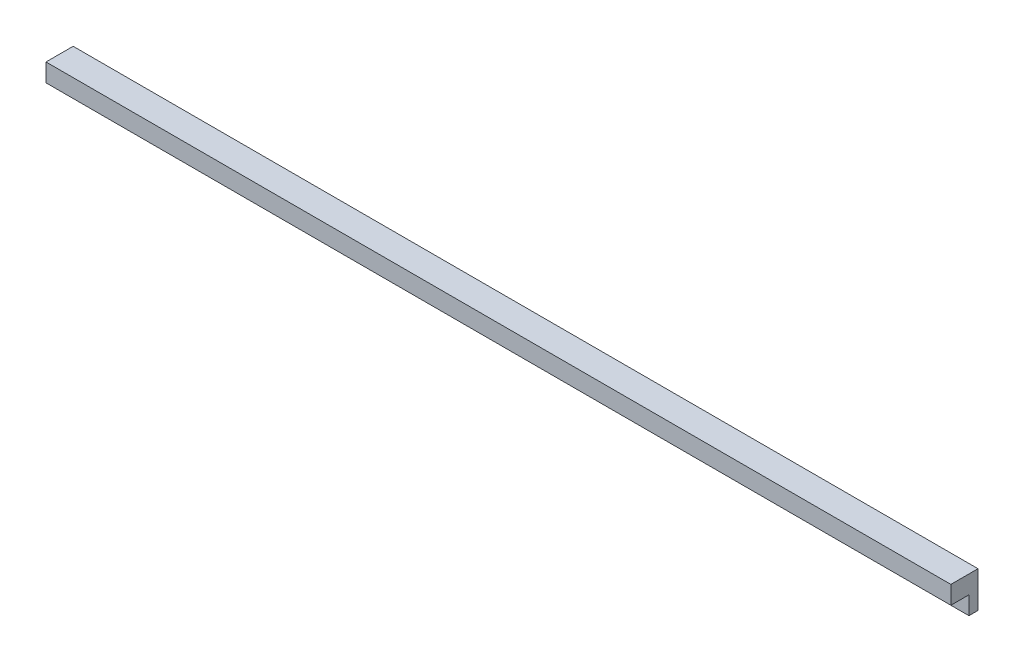
ISO-10303-21;
HEADER;
FILE_DESCRIPTION(('STEP AP214'),'2;1');
FILE_NAME('part.step','',(''),(''),'','','');
FILE_SCHEMA(('AUTOMOTIVE_DESIGN { 1 0 10303 214 1 1 1 1 }'));
ENDSEC;
DATA;
#1=APPLICATION_CONTEXT('core data for automotive mechanical design processes');
#2=APPLICATION_PROTOCOL_DEFINITION('international standard','automotive_design',2000,#1);
#3=PRODUCT_CONTEXT('',#1,'mechanical');
#4=PRODUCT('Part','Part','',(#3));
#5=PRODUCT_RELATED_PRODUCT_CATEGORY('part','',(#4));
#6=PRODUCT_DEFINITION_FORMATION('','',#4);
#7=PRODUCT_DEFINITION_CONTEXT('part definition',#1,'design');
#8=PRODUCT_DEFINITION('design','',#6,#7);
#9=PRODUCT_DEFINITION_SHAPE('','',#8);
#10=(LENGTH_UNIT() NAMED_UNIT(*) SI_UNIT(.MILLI.,.METRE.));
#11=(NAMED_UNIT(*) PLANE_ANGLE_UNIT() SI_UNIT($,.RADIAN.));
#12=(NAMED_UNIT(*) SI_UNIT($,.STERADIAN.) SOLID_ANGLE_UNIT());
#13=UNCERTAINTY_MEASURE_WITH_UNIT(LENGTH_MEASURE(1.E-05),#10,'distance_accuracy_value','');
#14=(GEOMETRIC_REPRESENTATION_CONTEXT(3) GLOBAL_UNCERTAINTY_ASSIGNED_CONTEXT((#13)) GLOBAL_UNIT_ASSIGNED_CONTEXT((#10,
#11,#12)) REPRESENTATION_CONTEXT('',''));
#15=CARTESIAN_POINT('',(0.,0.,0.));
#16=DIRECTION('',(0.,0.,1.));
#17=DIRECTION('',(1.,0.,0.));
#18=AXIS2_PLACEMENT_3D('',#15,#16,#17);
#19=CARTESIAN_POINT('',(-250.,10.,7.50000000000003));
#20=DIRECTION('',(1.,0.,0.));
#21=DIRECTION('',(0.,0.,-1.));
#22=AXIS2_PLACEMENT_3D('',#19,#20,#21);
#23=PLANE('',#22);
#24=DIRECTION('',(0.,-1.,0.));
#25=VECTOR('',#24,1.);
#26=CARTESIAN_POINT('',(-250.,10.,-7.49999999999997));
#27=LINE('',#26,#25);
#28=CARTESIAN_POINT('',(-250.,10.,-7.49999999999997));
#29=VERTEX_POINT('',#28);
#30=CARTESIAN_POINT('',(-250.,-10.,-7.49999999999997));
#31=VERTEX_POINT('',#30);
#32=EDGE_CURVE('E112',#29,#31,#27,.T.);
#33=ORIENTED_EDGE('',*,*,#32,.T.);
#34=DIRECTION('',(0.,0.,1.));
#35=VECTOR('',#34,1.);
#36=CARTESIAN_POINT('',(-250.,-10.,-7.49999999999997));
#37=LINE('',#36,#35);
#38=CARTESIAN_POINT('',(-250.,-10.,-2.49999999999997));
#39=VERTEX_POINT('',#38);
#40=EDGE_CURVE('E106',#31,#39,#37,.T.);
#41=ORIENTED_EDGE('',*,*,#40,.T.);
#42=DIRECTION('',(0.,1.,0.));
#43=VECTOR('',#42,1.);
#44=CARTESIAN_POINT('',(-250.,-10.,-2.49999999999997));
#45=LINE('',#44,#43);
#46=CARTESIAN_POINT('',(-250.,0.,-2.49999999999997));
#47=VERTEX_POINT('',#46);
#48=EDGE_CURVE('E92',#39,#47,#45,.T.);
#49=ORIENTED_EDGE('',*,*,#48,.T.);
#50=DIRECTION('',(0.,0.,1.));
#51=VECTOR('',#50,1.);
#52=CARTESIAN_POINT('',(-250.,0.,7.50000000000003));
#53=LINE('',#52,#51);
#54=CARTESIAN_POINT('',(-250.,0.,7.50000000000003));
#55=VERTEX_POINT('',#54);
#56=EDGE_CURVE('E128',#47,#55,#53,.T.);
#57=ORIENTED_EDGE('',*,*,#56,.T.);
#58=DIRECTION('',(0.,-1.,0.));
#59=VECTOR('',#58,1.);
#60=CARTESIAN_POINT('',(-250.,10.,7.50000000000003));
#61=LINE('',#60,#59);
#62=CARTESIAN_POINT('',(-250.,10.,7.50000000000003));
#63=VERTEX_POINT('',#62);
#64=EDGE_CURVE('E11',#63,#55,#61,.T.);
#65=ORIENTED_EDGE('',*,*,#64,.F.);
#66=DIRECTION('',(0.,0.,1.));
#67=VECTOR('',#66,1.);
#68=CARTESIAN_POINT('',(-250.,10.,7.50000000000003));
#69=LINE('',#68,#67);
#70=EDGE_CURVE('E120',#29,#63,#69,.T.);
#71=ORIENTED_EDGE('',*,*,#70,.F.);
#72=EDGE_LOOP('',(#33,#41,#49,#57,#65,#71));
#73=FACE_BOUND('',#72,.T.);
#74=ADVANCED_FACE('F33',(#73),#23,.F.);
#75=CARTESIAN_POINT('',(250.,10.,7.49999999999997));
#76=DIRECTION('',(0.,0.,-1.));
#77=DIRECTION('',(-1.,0.,0.));
#78=AXIS2_PLACEMENT_3D('',#75,#76,#77);
#79=PLANE('',#78);
#80=DIRECTION('',(1.,0.,0.));
#81=VECTOR('',#80,1.);
#82=CARTESIAN_POINT('',(250.,0.,7.49999999999997));
#83=LINE('',#82,#81);
#84=CARTESIAN_POINT('',(250.,0.,7.49999999999997));
#85=VERTEX_POINT('',#84);
#86=EDGE_CURVE('E73',#55,#85,#83,.T.);
#87=ORIENTED_EDGE('',*,*,#86,.T.);
#88=DIRECTION('',(0.,-1.,0.));
#89=VECTOR('',#88,1.);
#90=CARTESIAN_POINT('',(250.,10.,7.49999999999997));
#91=LINE('',#90,#89);
#92=CARTESIAN_POINT('',(250.,10.,7.49999999999997));
#93=VERTEX_POINT('',#92);
#94=EDGE_CURVE('E41',#93,#85,#91,.T.);
#95=ORIENTED_EDGE('',*,*,#94,.F.);
#96=DIRECTION('',(1.,0.,0.));
#97=VECTOR('',#96,1.);
#98=CARTESIAN_POINT('',(250.,10.,7.49999999999997));
#99=LINE('',#98,#97);
#100=EDGE_CURVE('E78',#63,#93,#99,.T.);
#101=ORIENTED_EDGE('',*,*,#100,.F.);
#102=ORIENTED_EDGE('',*,*,#64,.T.);
#103=EDGE_LOOP('',(#87,#95,#101,#102));
#104=FACE_BOUND('',#103,.T.);
#105=ADVANCED_FACE('F153',(#104),#79,.F.);
#106=CARTESIAN_POINT('',(250.,10.,7.49999999999997));
#107=DIRECTION('',(-1.,0.,0.));
#108=DIRECTION('',(0.,0.,1.));
#109=AXIS2_PLACEMENT_3D('',#106,#107,#108);
#110=PLANE('',#109);
#111=DIRECTION('',(0.,0.,-1.));
#112=VECTOR('',#111,1.);
#113=CARTESIAN_POINT('',(250.,0.,7.49999999999997));
#114=LINE('',#113,#112);
#115=CARTESIAN_POINT('',(250.,0.,-2.49999999999997));
#116=VERTEX_POINT('',#115);
#117=EDGE_CURVE('E124',#85,#116,#114,.T.);
#118=ORIENTED_EDGE('',*,*,#117,.T.);
#119=DIRECTION('',(0.,1.,0.));
#120=VECTOR('',#119,1.);
#121=CARTESIAN_POINT('',(250.,-10.,-2.49999999999997));
#122=LINE('',#121,#120);
#123=CARTESIAN_POINT('',(250.,-10.,-2.49999999999997));
#124=VERTEX_POINT('',#123);
#125=EDGE_CURVE('E49',#124,#116,#122,.T.);
#126=ORIENTED_EDGE('',*,*,#125,.F.);
#127=DIRECTION('',(0.,0.,-1.));
#128=VECTOR('',#127,1.);
#129=CARTESIAN_POINT('',(250.,-10.,-7.49999999999997));
#130=LINE('',#129,#128);
#131=CARTESIAN_POINT('',(250.,-10.,-7.49999999999997));
#132=VERTEX_POINT('',#131);
#133=EDGE_CURVE('E109',#124,#132,#130,.T.);
#134=ORIENTED_EDGE('',*,*,#133,.T.);
#135=DIRECTION('',(0.,-1.,0.));
#136=VECTOR('',#135,1.);
#137=CARTESIAN_POINT('',(250.,10.,-7.50000000000003));
#138=LINE('',#137,#136);
#139=CARTESIAN_POINT('',(250.,10.,-7.50000000000003));
#140=VERTEX_POINT('',#139);
#141=EDGE_CURVE('E140',#140,#132,#138,.T.);
#142=ORIENTED_EDGE('',*,*,#141,.F.);
#143=DIRECTION('',(0.,0.,-1.));
#144=VECTOR('',#143,1.);
#145=CARTESIAN_POINT('',(250.,10.,7.49999999999997));
#146=LINE('',#145,#144);
#147=EDGE_CURVE('E147',#93,#140,#146,.T.);
#148=ORIENTED_EDGE('',*,*,#147,.F.);
#149=ORIENTED_EDGE('',*,*,#94,.T.);
#150=EDGE_LOOP('',(#118,#126,#134,#142,#148,#149));
#151=FACE_BOUND('',#150,.T.);
#152=ADVANCED_FACE('F145',(#151),#110,.F.);
#153=CARTESIAN_POINT('',(250.,10.,-7.50000000000003));
#154=DIRECTION('',(0.,0.,1.));
#155=DIRECTION('',(1.,0.,0.));
#156=AXIS2_PLACEMENT_3D('',#153,#154,#155);
#157=PLANE('',#156);
#158=ORIENTED_EDGE('',*,*,#141,.T.);
#159=DIRECTION('',(-1.,0.,0.));
#160=VECTOR('',#159,1.);
#161=CARTESIAN_POINT('',(-250.,-10.,-7.49999999999997));
#162=LINE('',#161,#160);
#163=EDGE_CURVE('E100',#132,#31,#162,.T.);
#164=ORIENTED_EDGE('',*,*,#163,.T.);
#165=ORIENTED_EDGE('',*,*,#32,.F.);
#166=DIRECTION('',(-1.,0.,0.));
#167=VECTOR('',#166,1.);
#168=CARTESIAN_POINT('',(250.,10.,-7.50000000000003));
#169=LINE('',#168,#167);
#170=EDGE_CURVE('E58',#140,#29,#169,.T.);
#171=ORIENTED_EDGE('',*,*,#170,.F.);
#172=EDGE_LOOP('',(#158,#164,#165,#171));
#173=FACE_BOUND('',#172,.T.);
#174=ADVANCED_FACE('F152',(#173),#157,.F.);
#175=CARTESIAN_POINT('',(0.,10.,0.));
#176=DIRECTION('',(0.,1.,0.));
#177=DIRECTION('',(0.,0.,1.));
#178=AXIS2_PLACEMENT_3D('',#175,#176,#177);
#179=PLANE('',#178);
#180=ORIENTED_EDGE('',*,*,#70,.T.);
#181=ORIENTED_EDGE('',*,*,#100,.T.);
#182=ORIENTED_EDGE('',*,*,#147,.T.);
#183=ORIENTED_EDGE('',*,*,#170,.T.);
#184=EDGE_LOOP('',(#180,#181,#182,#183));
#185=FACE_BOUND('',#184,.T.);
#186=ADVANCED_FACE('F150',(#185),#179,.T.);
#187=CARTESIAN_POINT('',(0.,0.,0.));
#188=DIRECTION('',(0.,1.,0.));
#189=DIRECTION('',(0.,0.,1.));
#190=AXIS2_PLACEMENT_3D('',#187,#188,#189);
#191=PLANE('',#190);
#192=ORIENTED_EDGE('',*,*,#56,.F.);
#193=DIRECTION('',(1.,0.,0.));
#194=VECTOR('',#193,1.);
#195=CARTESIAN_POINT('',(-250.,0.,-2.49999999999997));
#196=LINE('',#195,#194);
#197=EDGE_CURVE('E96',#47,#116,#196,.T.);
#198=ORIENTED_EDGE('',*,*,#197,.T.);
#199=ORIENTED_EDGE('',*,*,#117,.F.);
#200=ORIENTED_EDGE('',*,*,#86,.F.);
#201=EDGE_LOOP('',(#192,#198,#199,#200));
#202=FACE_BOUND('',#201,.T.);
#203=ADVANCED_FACE('F149',(#202),#191,.F.);
#204=CARTESIAN_POINT('',(-250.,-10.,-2.49999999999997));
#205=DIRECTION('',(0.,0.,1.));
#206=DIRECTION('',(1.,0.,0.));
#207=AXIS2_PLACEMENT_3D('',#204,#205,#206);
#208=PLANE('',#207);
#209=ORIENTED_EDGE('',*,*,#197,.F.);
#210=ORIENTED_EDGE('',*,*,#48,.F.);
#211=DIRECTION('',(1.,0.,0.));
#212=VECTOR('',#211,1.);
#213=CARTESIAN_POINT('',(-250.,-10.,-2.49999999999997));
#214=LINE('',#213,#212);
#215=EDGE_CURVE('E95',#39,#124,#214,.T.);
#216=ORIENTED_EDGE('',*,*,#215,.T.);
#217=ORIENTED_EDGE('',*,*,#125,.T.);
#218=EDGE_LOOP('',(#209,#210,#216,#217));
#219=FACE_BOUND('',#218,.T.);
#220=ADVANCED_FACE('F94',(#219),#208,.T.);
#221=CARTESIAN_POINT('',(0.,-10.,0.));
#222=DIRECTION('',(0.,1.,0.));
#223=DIRECTION('',(0.,0.,1.));
#224=AXIS2_PLACEMENT_3D('',#221,#222,#223);
#225=PLANE('',#224);
#226=ORIENTED_EDGE('',*,*,#40,.F.);
#227=ORIENTED_EDGE('',*,*,#163,.F.);
#228=ORIENTED_EDGE('',*,*,#133,.F.);
#229=ORIENTED_EDGE('',*,*,#215,.F.);
#230=EDGE_LOOP('',(#226,#227,#228,#229));
#231=FACE_BOUND('',#230,.T.);
#232=ADVANCED_FACE('F104',(#231),#225,.F.);
#233=CLOSED_SHELL('',(#74,#105,#152,#174,#186,#203,#220,#232));
#234=MANIFOLD_SOLID_BREP('B2',#233);
#235=ADVANCED_BREP_SHAPE_REPRESENTATION('',(#18,#234),#14);
#236=SHAPE_DEFINITION_REPRESENTATION(#9,#235);
ENDSEC;
END-ISO-10303-21;
